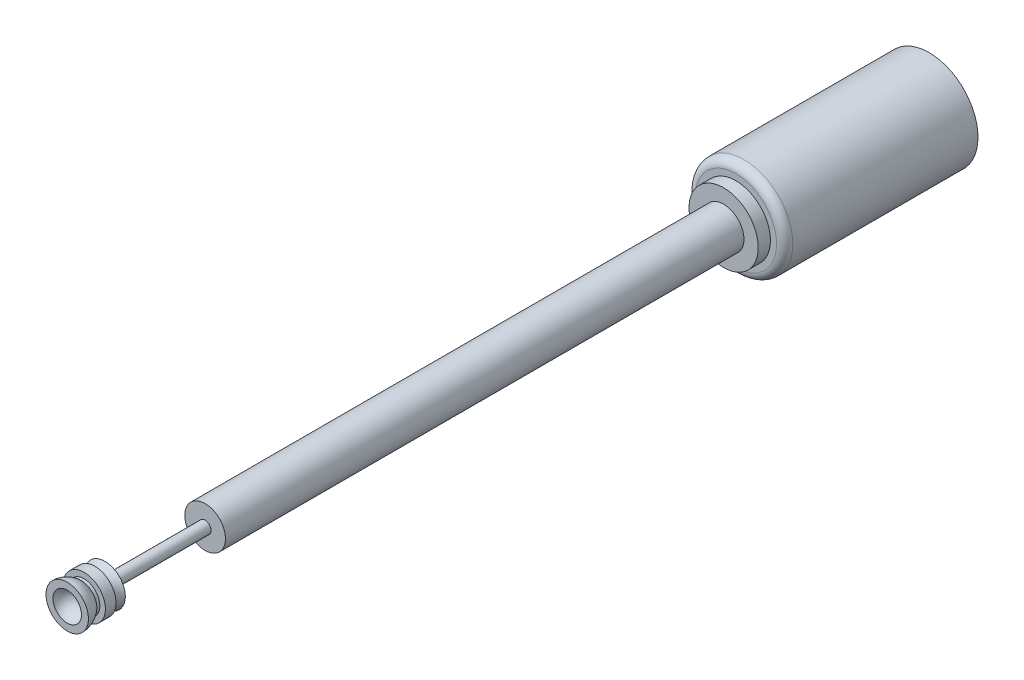
ISO-10303-21;
HEADER;
FILE_DESCRIPTION(('STEP AP214'),'2;1');
FILE_NAME('part.step','',(''),(''),'','','');
FILE_SCHEMA(('AUTOMOTIVE_DESIGN { 1 0 10303 214 1 1 1 1 }'));
ENDSEC;
DATA;
#1=APPLICATION_CONTEXT('core data for automotive mechanical design processes');
#2=APPLICATION_PROTOCOL_DEFINITION('international standard','automotive_design',2000,#1);
#3=PRODUCT_CONTEXT('',#1,'mechanical');
#4=PRODUCT('Part','Part','',(#3));
#5=PRODUCT_RELATED_PRODUCT_CATEGORY('part','',(#4));
#6=PRODUCT_DEFINITION_FORMATION('','',#4);
#7=PRODUCT_DEFINITION_CONTEXT('part definition',#1,'design');
#8=PRODUCT_DEFINITION('design','',#6,#7);
#9=PRODUCT_DEFINITION_SHAPE('','',#8);
#10=(LENGTH_UNIT() NAMED_UNIT(*) SI_UNIT(.MILLI.,.METRE.));
#11=(NAMED_UNIT(*) PLANE_ANGLE_UNIT() SI_UNIT($,.RADIAN.));
#12=(NAMED_UNIT(*) SI_UNIT($,.STERADIAN.) SOLID_ANGLE_UNIT());
#13=UNCERTAINTY_MEASURE_WITH_UNIT(LENGTH_MEASURE(1.E-05),#10,'distance_accuracy_value','');
#14=(GEOMETRIC_REPRESENTATION_CONTEXT(3) GLOBAL_UNCERTAINTY_ASSIGNED_CONTEXT((#13)) GLOBAL_UNIT_ASSIGNED_CONTEXT((#10,
#11,#12)) REPRESENTATION_CONTEXT('',''));
#15=CARTESIAN_POINT('',(0.,0.,0.));
#16=DIRECTION('',(0.,0.,1.));
#17=DIRECTION('',(1.,0.,0.));
#18=AXIS2_PLACEMENT_3D('',#15,#16,#17);
#19=CARTESIAN_POINT('',(0.,0.,15.7498192220322));
#20=DIRECTION('',(0.,0.,-1.));
#21=DIRECTION('',(-1.,0.,0.));
#22=AXIS2_PLACEMENT_3D('',#19,#20,#21);
#23=TOROIDAL_SURFACE('',#22,0.794136446603107,0.385909177031451);
#24=CARTESIAN_POINT('',(0.,0.,15.5));
#25=DIRECTION('',(0.,0.,-1.));
#26=DIRECTION('',(-1.,0.,0.));
#27=AXIS2_PLACEMENT_3D('',#24,#25,#26);
#28=CIRCLE('',#27,0.5);
#29=CARTESIAN_POINT('',(-0.5,0.,15.5));
#30=VERTEX_POINT('',#29);
#31=EDGE_CURVE('E77',#30,#30,#28,.T.);
#32=ORIENTED_EDGE('',*,*,#31,.F.);
#33=EDGE_LOOP('',(#32));
#34=FACE_BOUND('',#33,.T.);
#35=CARTESIAN_POINT('',(0.,0.,15.7498192220322));
#36=DIRECTION('',(0.,0.,-1.));
#37=DIRECTION('',(-1.,0.,0.));
#38=AXIS2_PLACEMENT_3D('',#35,#36,#37);
#39=CIRCLE('',#38,0.408227269571656);
#40=CARTESIAN_POINT('',(-0.408227269571656,0.,15.7498192220322));
#41=VERTEX_POINT('',#40);
#42=EDGE_CURVE('E12',#41,#41,#39,.T.);
#43=ORIENTED_EDGE('',*,*,#42,.T.);
#44=EDGE_LOOP('',(#43));
#45=FACE_BOUND('',#44,.T.);
#46=ADVANCED_FACE('F49',(#34,#45),#23,.F.);
#47=CARTESIAN_POINT('',(0.521160332257329,0.,15.7498192220322));
#48=DIRECTION('',(0.,0.,1.));
#49=DIRECTION('',(1.,0.,0.));
#50=AXIS2_PLACEMENT_3D('',#47,#48,#49);
#51=PLANE('',#50);
#52=ORIENTED_EDGE('',*,*,#42,.F.);
#53=EDGE_LOOP('',(#52));
#54=FACE_BOUND('',#53,.T.);
#55=CARTESIAN_POINT('',(0.,0.,15.7498192220322));
#56=DIRECTION('',(0.,0.,-1.));
#57=DIRECTION('',(-1.,0.,0.));
#58=AXIS2_PLACEMENT_3D('',#55,#56,#57);
#59=CIRCLE('',#58,0.521160332257329);
#60=CARTESIAN_POINT('',(-0.521160332257329,0.,15.7498192220322));
#61=VERTEX_POINT('',#60);
#62=EDGE_CURVE('E55',#61,#61,#59,.T.);
#63=ORIENTED_EDGE('',*,*,#62,.T.);
#64=EDGE_LOOP('',(#63));
#65=FACE_BOUND('',#64,.T.);
#66=ADVANCED_FACE('F84',(#54,#65),#51,.F.);
#67=CARTESIAN_POINT('',(0.,0.,15.5));
#68=DIRECTION('',(0.,0.,-1.));
#69=DIRECTION('',(-1.,0.,0.));
#70=AXIS2_PLACEMENT_3D('',#67,#68,#69);
#71=CYLINDRICAL_SURFACE('',#70,0.521160332257329);
#72=ORIENTED_EDGE('',*,*,#62,.F.);
#73=EDGE_LOOP('',(#72));
#74=FACE_BOUND('',#73,.T.);
#75=CARTESIAN_POINT('',(0.,0.,16.0105699967131));
#76=DIRECTION('',(0.,0.,-1.));
#77=DIRECTION('',(-1.,0.,0.));
#78=AXIS2_PLACEMENT_3D('',#75,#76,#77);
#79=CIRCLE('',#78,0.521160332257329);
#80=CARTESIAN_POINT('',(-0.521160332257329,0.,16.0105699967131));
#81=VERTEX_POINT('',#80);
#82=EDGE_CURVE('E59',#81,#81,#79,.T.);
#83=ORIENTED_EDGE('',*,*,#82,.T.);
#84=EDGE_LOOP('',(#83));
#85=FACE_BOUND('',#84,.T.);
#86=ADVANCED_FACE('F88',(#74,#85),#71,.T.);
#87=CARTESIAN_POINT('',(0.384418126519513,0.,16.0105699967131));
#88=DIRECTION('',(0.,0.,-1.));
#89=DIRECTION('',(-1.,0.,0.));
#90=AXIS2_PLACEMENT_3D('',#87,#88,#89);
#91=PLANE('',#90);
#92=ORIENTED_EDGE('',*,*,#82,.F.);
#93=EDGE_LOOP('',(#92));
#94=FACE_BOUND('',#93,.T.);
#95=CARTESIAN_POINT('',(0.,0.,16.0105699967131));
#96=DIRECTION('',(0.,0.,-1.));
#97=DIRECTION('',(-1.,0.,0.));
#98=AXIS2_PLACEMENT_3D('',#95,#96,#97);
#99=CIRCLE('',#98,0.384418126519513);
#100=CARTESIAN_POINT('',(-0.384418126519513,0.,16.0105699967131));
#101=VERTEX_POINT('',#100);
#102=EDGE_CURVE('E63',#101,#101,#99,.T.);
#103=ORIENTED_EDGE('',*,*,#102,.T.);
#104=EDGE_LOOP('',(#103));
#105=FACE_BOUND('',#104,.T.);
#106=ADVANCED_FACE('F93',(#94,#105),#91,.F.);
#107=CARTESIAN_POINT('',(0.,0.,15.5));
#108=DIRECTION('',(0.,0.,-1.));
#109=DIRECTION('',(-1.,0.,0.));
#110=AXIS2_PLACEMENT_3D('',#107,#108,#109);
#111=CYLINDRICAL_SURFACE('',#110,0.384418126519513);
#112=ORIENTED_EDGE('',*,*,#102,.F.);
#113=EDGE_LOOP('',(#112));
#114=FACE_BOUND('',#113,.T.);
#115=CARTESIAN_POINT('',(0.,0.,16.0839250083202));
#116=DIRECTION('',(0.,0.,-1.));
#117=DIRECTION('',(-1.,0.,0.));
#118=AXIS2_PLACEMENT_3D('',#115,#116,#117);
#119=CIRCLE('',#118,0.384418126519513);
#120=CARTESIAN_POINT('',(-0.384418126519513,0.,16.0839250083202));
#121=VERTEX_POINT('',#120);
#122=EDGE_CURVE('E68',#121,#121,#119,.T.);
#123=ORIENTED_EDGE('',*,*,#122,.T.);
#124=EDGE_LOOP('',(#123));
#125=FACE_BOUND('',#124,.T.);
#126=ADVANCED_FACE('F99',(#114,#125),#111,.T.);
#127=CARTESIAN_POINT('',(0.,0.,16.4275));
#128=DIRECTION('',(0.,0.,-1.));
#129=DIRECTION('',(-1.,0.,0.));
#130=AXIS2_PLACEMENT_3D('',#127,#128,#129);
#131=DEGENERATE_TOROIDAL_SURFACE('',#130,0.0211603322573293,0.5,.T.);
#132=ORIENTED_EDGE('',*,*,#122,.F.);
#133=EDGE_LOOP('',(#132));
#134=FACE_BOUND('',#133,.T.);
#135=CARTESIAN_POINT('',(0.,0.,16.4275));
#136=DIRECTION('',(0.,0.,-1.));
#137=DIRECTION('',(-1.,0.,0.));
#138=AXIS2_PLACEMENT_3D('',#135,#136,#137);
#139=CIRCLE('',#138,0.521160332257329);
#140=CARTESIAN_POINT('',(-0.521160332257329,0.,16.4275));
#141=VERTEX_POINT('',#140);
#142=EDGE_CURVE('E71',#141,#141,#139,.T.);
#143=ORIENTED_EDGE('',*,*,#142,.T.);
#144=EDGE_LOOP('',(#143));
#145=FACE_BOUND('',#144,.T.);
#146=ADVANCED_FACE('F103',(#134,#145),#131,.T.);
#147=CARTESIAN_POINT('',(0.35,0.,16.4275));
#148=DIRECTION('',(0.,0.,-1.));
#149=DIRECTION('',(-1.,0.,0.));
#150=AXIS2_PLACEMENT_3D('',#147,#148,#149);
#151=PLANE('',#150);
#152=ORIENTED_EDGE('',*,*,#142,.F.);
#153=EDGE_LOOP('',(#152));
#154=FACE_BOUND('',#153,.T.);
#155=CARTESIAN_POINT('',(0.,0.,16.4275));
#156=DIRECTION('',(0.,0.,-1.));
#157=DIRECTION('',(-1.,0.,0.));
#158=AXIS2_PLACEMENT_3D('',#155,#156,#157);
#159=CIRCLE('',#158,0.35);
#160=CARTESIAN_POINT('',(-0.35,0.,16.4275));
#161=VERTEX_POINT('',#160);
#162=EDGE_CURVE('E74',#161,#161,#159,.T.);
#163=ORIENTED_EDGE('',*,*,#162,.T.);
#164=EDGE_LOOP('',(#163));
#165=FACE_BOUND('',#164,.T.);
#166=ADVANCED_FACE('F107',(#154,#165),#151,.F.);
#167=CARTESIAN_POINT('',(0.,0.,16.4275));
#168=DIRECTION('',(0.,0.,-1.));
#169=DIRECTION('',(-1.,0.,0.));
#170=AXIS2_PLACEMENT_3D('',#167,#168,#169);
#171=SPHERICAL_SURFACE('',#170,0.35);
#172=ORIENTED_EDGE('',*,*,#162,.F.);
#173=EDGE_LOOP('',(#172));
#174=FACE_BOUND('',#173,.T.);
#175=ADVANCED_FACE('F111',(#174),#171,.F.);
#176=CARTESIAN_POINT('',(0.5,0.,15.5));
#177=DIRECTION('',(0.,0.,1.));
#178=DIRECTION('',(1.,0.,0.));
#179=AXIS2_PLACEMENT_3D('',#176,#177,#178);
#180=PLANE('',#179);
#181=ORIENTED_EDGE('',*,*,#31,.T.);
#182=EDGE_LOOP('',(#181));
#183=FACE_BOUND('',#182,.T.);
#184=ADVANCED_FACE('F81',(#183),#180,.F.);
#185=CLOSED_SHELL('',(#46,#66,#86,#106,#126,#146,#166,#175,#184));
#186=MANIFOLD_SOLID_BREP('B2',#185);
#187=CARTESIAN_POINT('',(0.,0.,-4.75));
#188=DIRECTION('',(0.,0.,1.));
#189=DIRECTION('',(1.,0.,0.));
#190=AXIS2_PLACEMENT_3D('',#187,#188,#189);
#191=CYLINDRICAL_SURFACE('',#190,1.2);
#192=CARTESIAN_POINT('',(0.,0.,-0.2));
#193=DIRECTION('',(0.,0.,1.));
#194=DIRECTION('',(1.,0.,0.));
#195=AXIS2_PLACEMENT_3D('',#192,#193,#194);
#196=CIRCLE('',#195,1.2);
#197=CARTESIAN_POINT('',(1.2,0.,-0.2));
#198=VERTEX_POINT('',#197);
#199=EDGE_CURVE('E48',#198,#198,#196,.F.);
#200=ORIENTED_EDGE('',*,*,#199,.T.);
#201=EDGE_LOOP('',(#200));
#202=FACE_BOUND('',#201,.T.);
#203=CARTESIAN_POINT('',(0.,0.,-4.75));
#204=DIRECTION('',(0.,0.,1.));
#205=DIRECTION('',(1.,0.,0.));
#206=AXIS2_PLACEMENT_3D('',#203,#204,#205);
#207=CIRCLE('',#206,1.2);
#208=CARTESIAN_POINT('',(1.2,0.,-4.75));
#209=VERTEX_POINT('',#208);
#210=EDGE_CURVE('E208',#209,#209,#207,.T.);
#211=ORIENTED_EDGE('',*,*,#210,.T.);
#212=EDGE_LOOP('',(#211));
#213=FACE_BOUND('',#212,.T.);
#214=ADVANCED_FACE('F196',(#202,#213),#191,.T.);
#215=CARTESIAN_POINT('',(0.,0.,-4.75));
#216=DIRECTION('',(0.,0.,1.));
#217=DIRECTION('',(1.,0.,0.));
#218=AXIS2_PLACEMENT_3D('',#215,#216,#217);
#219=PLANE('',#218);
#220=ORIENTED_EDGE('',*,*,#210,.F.);
#221=EDGE_LOOP('',(#220));
#222=FACE_BOUND('',#221,.T.);
#223=ADVANCED_FACE('F242',(#222),#219,.F.);
#224=CARTESIAN_POINT('',(0.,0.,0.));
#225=DIRECTION('',(0.,0.,1.));
#226=DIRECTION('',(1.,0.,0.));
#227=AXIS2_PLACEMENT_3D('',#224,#225,#226);
#228=PLANE('',#227);
#229=CARTESIAN_POINT('',(0.,0.,0.));
#230=DIRECTION('',(0.,0.,1.));
#231=DIRECTION('',(1.,0.,0.));
#232=AXIS2_PLACEMENT_3D('',#229,#230,#231);
#233=CIRCLE('',#232,0.85);
#234=CARTESIAN_POINT('',(0.85,0.,0.));
#235=VERTEX_POINT('',#234);
#236=EDGE_CURVE('E214',#235,#235,#233,.T.);
#237=ORIENTED_EDGE('',*,*,#236,.F.);
#238=EDGE_LOOP('',(#237));
#239=FACE_BOUND('',#238,.T.);
#240=CARTESIAN_POINT('',(0.,0.,0.));
#241=DIRECTION('',(0.,0.,1.));
#242=DIRECTION('',(1.,0.,0.));
#243=AXIS2_PLACEMENT_3D('',#240,#241,#242);
#244=CIRCLE('',#243,1.);
#245=CARTESIAN_POINT('',(1.,0.,0.));
#246=VERTEX_POINT('',#245);
#247=EDGE_CURVE('E204',#246,#246,#244,.T.);
#248=ORIENTED_EDGE('',*,*,#247,.T.);
#249=EDGE_LOOP('',(#248));
#250=FACE_BOUND('',#249,.T.);
#251=ADVANCED_FACE('F246',(#239,#250),#228,.T.);
#252=CARTESIAN_POINT('',(0.,0.,-0.2));
#253=DIRECTION('',(0.,0.,1.));
#254=DIRECTION('',(1.,0.,0.));
#255=AXIS2_PLACEMENT_3D('',#252,#253,#254);
#256=TOROIDAL_SURFACE('',#255,1.,0.2);
#257=ORIENTED_EDGE('',*,*,#199,.F.);
#258=EDGE_LOOP('',(#257));
#259=FACE_BOUND('',#258,.T.);
#260=ORIENTED_EDGE('',*,*,#247,.F.);
#261=EDGE_LOOP('',(#260));
#262=FACE_BOUND('',#261,.T.);
#263=ADVANCED_FACE('F198',(#259,#262),#256,.T.);
#264=CARTESIAN_POINT('',(0.,0.,0.3));
#265=DIRECTION('',(0.,0.,-1.));
#266=DIRECTION('',(-1.,0.,0.));
#267=AXIS2_PLACEMENT_3D('',#264,#265,#266);
#268=CYLINDRICAL_SURFACE('',#267,0.85);
#269=CARTESIAN_POINT('',(0.,0.,0.3));
#270=DIRECTION('',(0.,0.,1.));
#271=DIRECTION('',(1.,0.,0.));
#272=AXIS2_PLACEMENT_3D('',#269,#270,#271);
#273=CIRCLE('',#272,0.85);
#274=CARTESIAN_POINT('',(0.85,0.,0.3));
#275=VERTEX_POINT('',#274);
#276=EDGE_CURVE('E213',#275,#275,#273,.T.);
#277=ORIENTED_EDGE('',*,*,#276,.F.);
#278=EDGE_LOOP('',(#277));
#279=FACE_BOUND('',#278,.T.);
#280=ORIENTED_EDGE('',*,*,#236,.T.);
#281=EDGE_LOOP('',(#280));
#282=FACE_BOUND('',#281,.T.);
#283=ADVANCED_FACE('F254',(#279,#282),#268,.T.);
#284=CARTESIAN_POINT('',(0.,0.,0.3));
#285=DIRECTION('',(0.,0.,1.));
#286=DIRECTION('',(1.,0.,0.));
#287=AXIS2_PLACEMENT_3D('',#284,#285,#286);
#288=PLANE('',#287);
#289=CARTESIAN_POINT('',(0.,0.,0.3));
#290=DIRECTION('',(0.,0.,1.));
#291=DIRECTION('',(1.,0.,0.));
#292=AXIS2_PLACEMENT_3D('',#289,#290,#291);
#293=CIRCLE('',#292,0.5);
#294=CARTESIAN_POINT('',(0.5,0.,0.3));
#295=VERTEX_POINT('',#294);
#296=EDGE_CURVE('E200',#295,#295,#293,.F.);
#297=ORIENTED_EDGE('',*,*,#296,.T.);
#298=EDGE_LOOP('',(#297));
#299=FACE_BOUND('',#298,.T.);
#300=ORIENTED_EDGE('',*,*,#276,.T.);
#301=EDGE_LOOP('',(#300));
#302=FACE_BOUND('',#301,.T.);
#303=ADVANCED_FACE('F257',(#299,#302),#288,.T.);
#304=CARTESIAN_POINT('',(0.,0.,15.5));
#305=DIRECTION('',(0.,0.,-1.));
#306=DIRECTION('',(-1.,0.,0.));
#307=AXIS2_PLACEMENT_3D('',#304,#305,#306);
#308=CYLINDRICAL_SURFACE('',#307,0.5);
#309=ORIENTED_EDGE('',*,*,#296,.F.);
#310=EDGE_LOOP('',(#309));
#311=FACE_BOUND('',#310,.T.);
#312=CARTESIAN_POINT('',(0.,0.,13.04));
#313=DIRECTION('',(0.,0.,-1.));
#314=DIRECTION('',(-1.,0.,0.));
#315=AXIS2_PLACEMENT_3D('',#312,#313,#314);
#316=CIRCLE('',#315,0.5);
#317=CARTESIAN_POINT('',(-0.5,0.,13.04));
#318=VERTEX_POINT('',#317);
#319=EDGE_CURVE('E219',#318,#318,#316,.T.);
#320=ORIENTED_EDGE('',*,*,#319,.T.);
#321=EDGE_LOOP('',(#320));
#322=FACE_BOUND('',#321,.T.);
#323=ADVANCED_FACE('F260',(#311,#322),#308,.T.);
#324=CARTESIAN_POINT('',(-0.1481,0.,13.04));
#325=DIRECTION('',(0.,0.,-1.));
#326=DIRECTION('',(-1.,0.,0.));
#327=AXIS2_PLACEMENT_3D('',#324,#325,#326);
#328=PLANE('',#327);
#329=CARTESIAN_POINT('',(0.,0.,13.04));
#330=DIRECTION('',(0.,0.,-1.));
#331=DIRECTION('',(-1.,0.,0.));
#332=AXIS2_PLACEMENT_3D('',#329,#330,#331);
#333=CIRCLE('',#332,0.1481);
#334=CARTESIAN_POINT('',(-0.1481,0.,13.04));
#335=VERTEX_POINT('',#334);
#336=EDGE_CURVE('E222',#335,#335,#333,.T.);
#337=ORIENTED_EDGE('',*,*,#336,.T.);
#338=EDGE_LOOP('',(#337));
#339=FACE_BOUND('',#338,.T.);
#340=ORIENTED_EDGE('',*,*,#319,.F.);
#341=EDGE_LOOP('',(#340));
#342=FACE_BOUND('',#341,.T.);
#343=ADVANCED_FACE('F237',(#339,#342),#328,.F.);
#344=CARTESIAN_POINT('',(0.,0.,15.5));
#345=DIRECTION('',(0.,0.,-1.));
#346=DIRECTION('',(-1.,0.,0.));
#347=AXIS2_PLACEMENT_3D('',#344,#345,#346);
#348=CYLINDRICAL_SURFACE('',#347,0.1481);
#349=ORIENTED_EDGE('',*,*,#336,.F.);
#350=EDGE_LOOP('',(#349));
#351=FACE_BOUND('',#350,.T.);
#352=CARTESIAN_POINT('',(0.,0.,15.5));
#353=DIRECTION('',(0.,0.,-1.));
#354=DIRECTION('',(-1.,0.,0.));
#355=AXIS2_PLACEMENT_3D('',#352,#353,#354);
#356=CIRCLE('',#355,0.1481);
#357=CARTESIAN_POINT('',(-0.1481,0.,15.5));
#358=VERTEX_POINT('',#357);
#359=EDGE_CURVE('E225',#358,#358,#356,.T.);
#360=ORIENTED_EDGE('',*,*,#359,.T.);
#361=EDGE_LOOP('',(#360));
#362=FACE_BOUND('',#361,.T.);
#363=ADVANCED_FACE('F229',(#351,#362),#348,.T.);
#364=CARTESIAN_POINT('',(0.,0.,15.5));
#365=DIRECTION('',(0.,0.,1.));
#366=DIRECTION('',(1.,0.,0.));
#367=AXIS2_PLACEMENT_3D('',#364,#365,#366);
#368=PLANE('',#367);
#369=ORIENTED_EDGE('',*,*,#359,.F.);
#370=EDGE_LOOP('',(#369));
#371=FACE_BOUND('',#370,.T.);
#372=ADVANCED_FACE('F231',(#371),#368,.T.);
#373=CLOSED_SHELL('',(#214,#223,#251,#263,#283,#303,#323,#343,#363,#372));
#374=MANIFOLD_SOLID_BREP('B7',#373);
#375=ADVANCED_BREP_SHAPE_REPRESENTATION('',(#18,#186,#374),#14);
#376=SHAPE_DEFINITION_REPRESENTATION(#9,#375);
ENDSEC;
END-ISO-10303-21;
